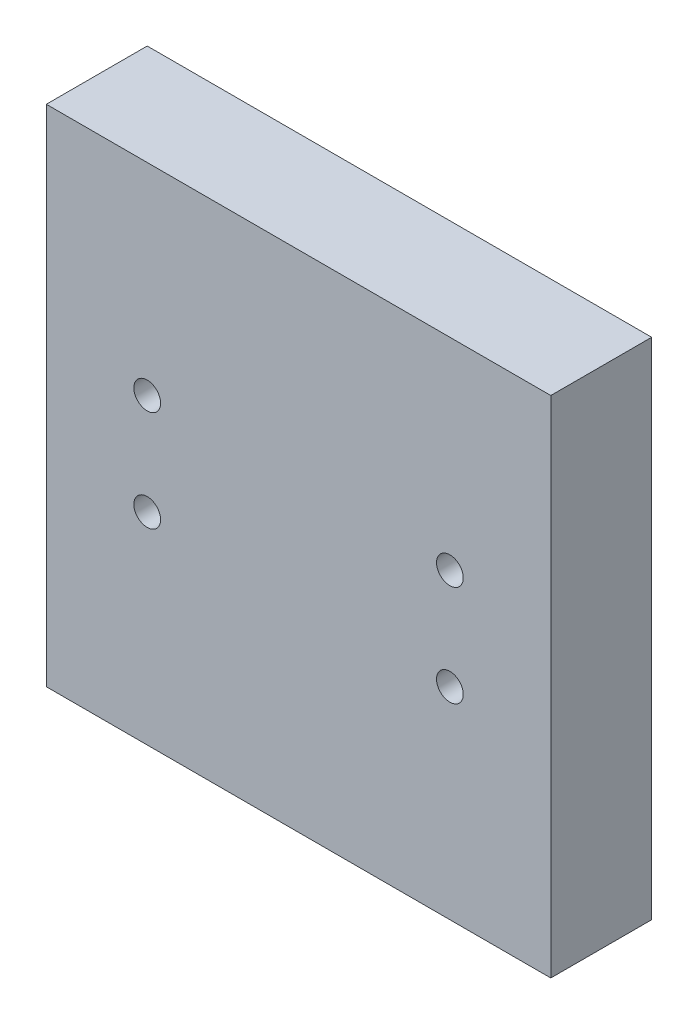
ISO-10303-21;
HEADER;
FILE_DESCRIPTION(('STEP AP214'),'2;1');
FILE_NAME('part.step','',(''),(''),'','','');
FILE_SCHEMA(('AUTOMOTIVE_DESIGN { 1 0 10303 214 1 1 1 1 }'));
ENDSEC;
DATA;
#1=APPLICATION_CONTEXT('core data for automotive mechanical design processes');
#2=APPLICATION_PROTOCOL_DEFINITION('international standard','automotive_design',2000,#1);
#3=PRODUCT_CONTEXT('',#1,'mechanical');
#4=PRODUCT('Part','Part','',(#3));
#5=PRODUCT_RELATED_PRODUCT_CATEGORY('part','',(#4));
#6=PRODUCT_DEFINITION_FORMATION('','',#4);
#7=PRODUCT_DEFINITION_CONTEXT('part definition',#1,'design');
#8=PRODUCT_DEFINITION('design','',#6,#7);
#9=PRODUCT_DEFINITION_SHAPE('','',#8);
#10=(LENGTH_UNIT() NAMED_UNIT(*) SI_UNIT(.MILLI.,.METRE.));
#11=(NAMED_UNIT(*) PLANE_ANGLE_UNIT() SI_UNIT($,.RADIAN.));
#12=(NAMED_UNIT(*) SI_UNIT($,.STERADIAN.) SOLID_ANGLE_UNIT());
#13=UNCERTAINTY_MEASURE_WITH_UNIT(LENGTH_MEASURE(1.E-05),#10,'distance_accuracy_value','');
#14=(GEOMETRIC_REPRESENTATION_CONTEXT(3) GLOBAL_UNCERTAINTY_ASSIGNED_CONTEXT((#13)) GLOBAL_UNIT_ASSIGNED_CONTEXT((#10,
#11,#12)) REPRESENTATION_CONTEXT('',''));
#15=CARTESIAN_POINT('',(0.,0.,0.));
#16=DIRECTION('',(0.,0.,1.));
#17=DIRECTION('',(1.,0.,0.));
#18=AXIS2_PLACEMENT_3D('',#15,#16,#17);
#19=CARTESIAN_POINT('',(50.,-50.,20.));
#20=DIRECTION('',(-1.,0.,0.));
#21=DIRECTION('',(0.,0.,1.));
#22=AXIS2_PLACEMENT_3D('',#19,#20,#21);
#23=PLANE('',#22);
#24=DIRECTION('',(0.,1.,0.));
#25=VECTOR('',#24,1.);
#26=CARTESIAN_POINT('',(50.,-50.,0.));
#27=LINE('',#26,#25);
#28=CARTESIAN_POINT('',(50.,-50.,0.));
#29=VERTEX_POINT('',#28);
#30=CARTESIAN_POINT('',(50.,50.,0.));
#31=VERTEX_POINT('',#30);
#32=EDGE_CURVE('E95',#29,#31,#27,.T.);
#33=ORIENTED_EDGE('',*,*,#32,.T.);
#34=DIRECTION('',(0.,0.,-1.));
#35=VECTOR('',#34,1.);
#36=CARTESIAN_POINT('',(50.,50.,20.));
#37=LINE('',#36,#35);
#38=CARTESIAN_POINT('',(50.,50.,20.));
#39=VERTEX_POINT('',#38);
#40=EDGE_CURVE('E11',#39,#31,#37,.T.);
#41=ORIENTED_EDGE('',*,*,#40,.F.);
#42=DIRECTION('',(0.,1.,0.));
#43=VECTOR('',#42,1.);
#44=CARTESIAN_POINT('',(50.,-50.,20.));
#45=LINE('',#44,#43);
#46=CARTESIAN_POINT('',(50.,-50.,20.));
#47=VERTEX_POINT('',#46);
#48=EDGE_CURVE('E83',#47,#39,#45,.T.);
#49=ORIENTED_EDGE('',*,*,#48,.F.);
#50=DIRECTION('',(0.,0.,-1.));
#51=VECTOR('',#50,1.);
#52=CARTESIAN_POINT('',(50.,-50.,20.));
#53=LINE('',#52,#51);
#54=EDGE_CURVE('E91',#47,#29,#53,.T.);
#55=ORIENTED_EDGE('',*,*,#54,.T.);
#56=EDGE_LOOP('',(#33,#41,#49,#55));
#57=FACE_BOUND('',#56,.T.);
#58=ADVANCED_FACE('F32',(#57),#23,.F.);
#59=CARTESIAN_POINT('',(-50.,50.,20.));
#60=DIRECTION('',(0.,-1.,0.));
#61=DIRECTION('',(0.,0.,-1.));
#62=AXIS2_PLACEMENT_3D('',#59,#60,#61);
#63=PLANE('',#62);
#64=DIRECTION('',(-1.,0.,0.));
#65=VECTOR('',#64,1.);
#66=CARTESIAN_POINT('',(-50.,50.,0.));
#67=LINE('',#66,#65);
#68=CARTESIAN_POINT('',(-50.,50.,0.));
#69=VERTEX_POINT('',#68);
#70=EDGE_CURVE('E87',#31,#69,#67,.T.);
#71=ORIENTED_EDGE('',*,*,#70,.T.);
#72=DIRECTION('',(0.,0.,-1.));
#73=VECTOR('',#72,1.);
#74=CARTESIAN_POINT('',(-50.,50.,20.));
#75=LINE('',#74,#73);
#76=CARTESIAN_POINT('',(-50.,50.,20.));
#77=VERTEX_POINT('',#76);
#78=EDGE_CURVE('E40',#77,#69,#75,.T.);
#79=ORIENTED_EDGE('',*,*,#78,.F.);
#80=DIRECTION('',(-1.,0.,0.));
#81=VECTOR('',#80,1.);
#82=CARTESIAN_POINT('',(-50.,50.,20.));
#83=LINE('',#82,#81);
#84=EDGE_CURVE('E78',#39,#77,#83,.T.);
#85=ORIENTED_EDGE('',*,*,#84,.F.);
#86=ORIENTED_EDGE('',*,*,#40,.T.);
#87=EDGE_LOOP('',(#71,#79,#85,#86));
#88=FACE_BOUND('',#87,.T.);
#89=ADVANCED_FACE('F86',(#88),#63,.F.);
#90=CARTESIAN_POINT('',(-50.,-50.,20.));
#91=DIRECTION('',(1.,0.,0.));
#92=DIRECTION('',(0.,0.,-1.));
#93=AXIS2_PLACEMENT_3D('',#90,#91,#92);
#94=PLANE('',#93);
#95=DIRECTION('',(0.,-1.,0.));
#96=VECTOR('',#95,1.);
#97=CARTESIAN_POINT('',(-50.,-50.,0.));
#98=LINE('',#97,#96);
#99=CARTESIAN_POINT('',(-50.,-50.,0.));
#100=VERTEX_POINT('',#99);
#101=EDGE_CURVE('E65',#69,#100,#98,.T.);
#102=ORIENTED_EDGE('',*,*,#101,.T.);
#103=DIRECTION('',(0.,0.,-1.));
#104=VECTOR('',#103,1.);
#105=CARTESIAN_POINT('',(-50.,-50.,20.));
#106=LINE('',#105,#104);
#107=CARTESIAN_POINT('',(-50.,-50.,20.));
#108=VERTEX_POINT('',#107);
#109=EDGE_CURVE('E88',#108,#100,#106,.T.);
#110=ORIENTED_EDGE('',*,*,#109,.F.);
#111=DIRECTION('',(0.,-1.,0.));
#112=VECTOR('',#111,1.);
#113=CARTESIAN_POINT('',(-50.,-50.,20.));
#114=LINE('',#113,#112);
#115=EDGE_CURVE('E81',#77,#108,#114,.T.);
#116=ORIENTED_EDGE('',*,*,#115,.F.);
#117=ORIENTED_EDGE('',*,*,#78,.T.);
#118=EDGE_LOOP('',(#102,#110,#116,#117));
#119=FACE_BOUND('',#118,.T.);
#120=ADVANCED_FACE('F89',(#119),#94,.F.);
#121=CARTESIAN_POINT('',(-50.,-50.,20.));
#122=DIRECTION('',(0.,1.,0.));
#123=DIRECTION('',(0.,0.,1.));
#124=AXIS2_PLACEMENT_3D('',#121,#122,#123);
#125=PLANE('',#124);
#126=DIRECTION('',(1.,0.,0.));
#127=VECTOR('',#126,1.);
#128=CARTESIAN_POINT('',(-50.,-50.,0.));
#129=LINE('',#128,#127);
#130=EDGE_CURVE('E71',#100,#29,#129,.T.);
#131=ORIENTED_EDGE('',*,*,#130,.T.);
#132=ORIENTED_EDGE('',*,*,#54,.F.);
#133=DIRECTION('',(1.,0.,0.));
#134=VECTOR('',#133,1.);
#135=CARTESIAN_POINT('',(-50.,-50.,20.));
#136=LINE('',#135,#134);
#137=EDGE_CURVE('E48',#108,#47,#136,.T.);
#138=ORIENTED_EDGE('',*,*,#137,.F.);
#139=ORIENTED_EDGE('',*,*,#109,.T.);
#140=EDGE_LOOP('',(#131,#132,#138,#139));
#141=FACE_BOUND('',#140,.T.);
#142=ADVANCED_FACE('F103',(#141),#125,.F.);
#143=CARTESIAN_POINT('',(50.,50.,20.));
#144=DIRECTION('',(0.,0.,-1.));
#145=DIRECTION('',(-1.,0.,0.));
#146=AXIS2_PLACEMENT_3D('',#143,#144,#145);
#147=PLANE('',#146);
#148=CARTESIAN_POINT('',(30.,10.,20.));
#149=DIRECTION('',(0.,0.,-1.));
#150=DIRECTION('',(-1.,0.,0.));
#151=AXIS2_PLACEMENT_3D('',#148,#149,#150);
#152=CIRCLE('',#151,2.65);
#153=CARTESIAN_POINT('',(27.35,10.,20.));
#154=VERTEX_POINT('',#153);
#155=EDGE_CURVE('E135',#154,#154,#152,.T.);
#156=ORIENTED_EDGE('',*,*,#155,.T.);
#157=EDGE_LOOP('',(#156));
#158=FACE_BOUND('',#157,.T.);
#159=CARTESIAN_POINT('',(-30.,10.,20.));
#160=DIRECTION('',(0.,0.,-1.));
#161=DIRECTION('',(-1.,0.,0.));
#162=AXIS2_PLACEMENT_3D('',#159,#160,#161);
#163=CIRCLE('',#162,2.65);
#164=CARTESIAN_POINT('',(-32.65,10.,20.));
#165=VERTEX_POINT('',#164);
#166=EDGE_CURVE('E126',#165,#165,#163,.T.);
#167=ORIENTED_EDGE('',*,*,#166,.T.);
#168=EDGE_LOOP('',(#167));
#169=FACE_BOUND('',#168,.T.);
#170=CARTESIAN_POINT('',(-30.,-10.,20.));
#171=DIRECTION('',(0.,0.,-1.));
#172=DIRECTION('',(-1.,0.,0.));
#173=AXIS2_PLACEMENT_3D('',#170,#171,#172);
#174=CIRCLE('',#173,2.65);
#175=CARTESIAN_POINT('',(-32.65,-10.,20.));
#176=VERTEX_POINT('',#175);
#177=EDGE_CURVE('E117',#176,#176,#174,.T.);
#178=ORIENTED_EDGE('',*,*,#177,.T.);
#179=EDGE_LOOP('',(#178));
#180=FACE_BOUND('',#179,.T.);
#181=CARTESIAN_POINT('',(30.,-10.,20.));
#182=DIRECTION('',(0.,0.,-1.));
#183=DIRECTION('',(-1.,0.,0.));
#184=AXIS2_PLACEMENT_3D('',#181,#182,#183);
#185=CIRCLE('',#184,2.65);
#186=CARTESIAN_POINT('',(27.35,-10.,20.));
#187=VERTEX_POINT('',#186);
#188=EDGE_CURVE('E98',#187,#187,#185,.T.);
#189=ORIENTED_EDGE('',*,*,#188,.T.);
#190=EDGE_LOOP('',(#189));
#191=FACE_BOUND('',#190,.T.);
#192=ORIENTED_EDGE('',*,*,#48,.T.);
#193=ORIENTED_EDGE('',*,*,#84,.T.);
#194=ORIENTED_EDGE('',*,*,#115,.T.);
#195=ORIENTED_EDGE('',*,*,#137,.T.);
#196=EDGE_LOOP('',(#192,#193,#194,#195));
#197=FACE_BOUND('',#196,.T.);
#198=ADVANCED_FACE('F79',(#158,#169,#180,#191,#197),#147,.F.);
#199=CARTESIAN_POINT('',(50.,50.,0.));
#200=DIRECTION('',(0.,0.,-1.));
#201=DIRECTION('',(-1.,0.,0.));
#202=AXIS2_PLACEMENT_3D('',#199,#200,#201);
#203=PLANE('',#202);
#204=CARTESIAN_POINT('',(30.,10.,0.));
#205=DIRECTION('',(0.,0.,-1.));
#206=DIRECTION('',(-1.,0.,0.));
#207=AXIS2_PLACEMENT_3D('',#204,#205,#206);
#208=CIRCLE('',#207,5.2);
#209=CARTESIAN_POINT('',(24.8,10.,0.));
#210=VERTEX_POINT('',#209);
#211=EDGE_CURVE('E141',#210,#210,#208,.T.);
#212=ORIENTED_EDGE('',*,*,#211,.F.);
#213=EDGE_LOOP('',(#212));
#214=FACE_BOUND('',#213,.T.);
#215=CARTESIAN_POINT('',(-30.,10.,0.));
#216=DIRECTION('',(0.,0.,-1.));
#217=DIRECTION('',(-1.,0.,0.));
#218=AXIS2_PLACEMENT_3D('',#215,#216,#217);
#219=CIRCLE('',#218,5.2);
#220=CARTESIAN_POINT('',(-35.2,10.,0.));
#221=VERTEX_POINT('',#220);
#222=EDGE_CURVE('E132',#221,#221,#219,.T.);
#223=ORIENTED_EDGE('',*,*,#222,.F.);
#224=EDGE_LOOP('',(#223));
#225=FACE_BOUND('',#224,.T.);
#226=CARTESIAN_POINT('',(-30.,-10.,0.));
#227=DIRECTION('',(0.,0.,-1.));
#228=DIRECTION('',(-1.,0.,0.));
#229=AXIS2_PLACEMENT_3D('',#226,#227,#228);
#230=CIRCLE('',#229,5.2);
#231=CARTESIAN_POINT('',(-35.2,-10.,0.));
#232=VERTEX_POINT('',#231);
#233=EDGE_CURVE('E123',#232,#232,#230,.T.);
#234=ORIENTED_EDGE('',*,*,#233,.F.);
#235=EDGE_LOOP('',(#234));
#236=FACE_BOUND('',#235,.T.);
#237=CARTESIAN_POINT('',(30.,-10.,0.));
#238=DIRECTION('',(0.,0.,-1.));
#239=DIRECTION('',(-1.,0.,0.));
#240=AXIS2_PLACEMENT_3D('',#237,#238,#239);
#241=CIRCLE('',#240,5.2);
#242=CARTESIAN_POINT('',(24.8,-10.,0.));
#243=VERTEX_POINT('',#242);
#244=EDGE_CURVE('E114',#243,#243,#241,.T.);
#245=ORIENTED_EDGE('',*,*,#244,.F.);
#246=EDGE_LOOP('',(#245));
#247=FACE_BOUND('',#246,.T.);
#248=ORIENTED_EDGE('',*,*,#32,.F.);
#249=ORIENTED_EDGE('',*,*,#130,.F.);
#250=ORIENTED_EDGE('',*,*,#101,.F.);
#251=ORIENTED_EDGE('',*,*,#70,.F.);
#252=EDGE_LOOP('',(#248,#249,#250,#251));
#253=FACE_BOUND('',#252,.T.);
#254=ADVANCED_FACE('F106',(#214,#225,#236,#247,#253),#203,.T.);
#255=CARTESIAN_POINT('',(30.,-10.,0.));
#256=DIRECTION('',(0.,0.,-1.));
#257=DIRECTION('',(-1.,0.,0.));
#258=AXIS2_PLACEMENT_3D('',#255,#256,#257);
#259=CYLINDRICAL_SURFACE('',#258,2.65);
#260=ORIENTED_EDGE('',*,*,#188,.F.);
#261=EDGE_LOOP('',(#260));
#262=FACE_BOUND('',#261,.T.);
#263=CARTESIAN_POINT('',(30.,-10.,2.55));
#264=DIRECTION('',(0.,0.,-1.));
#265=DIRECTION('',(-1.,0.,0.));
#266=AXIS2_PLACEMENT_3D('',#263,#264,#265);
#267=CIRCLE('',#266,2.65);
#268=CARTESIAN_POINT('',(27.35,-10.,2.55));
#269=VERTEX_POINT('',#268);
#270=EDGE_CURVE('E111',#269,#269,#267,.T.);
#271=ORIENTED_EDGE('',*,*,#270,.T.);
#272=EDGE_LOOP('',(#271));
#273=FACE_BOUND('',#272,.T.);
#274=ADVANCED_FACE('F149',(#262,#273),#259,.F.);
#275=CARTESIAN_POINT('',(30.,-10.,0.));
#276=DIRECTION('',(0.,0.,-1.));
#277=DIRECTION('',(-1.,0.,0.));
#278=AXIS2_PLACEMENT_3D('',#275,#276,#277);
#279=CONICAL_SURFACE('',#278,5.2,0.785398163397448);
#280=ORIENTED_EDGE('',*,*,#270,.F.);
#281=EDGE_LOOP('',(#280));
#282=FACE_BOUND('',#281,.T.);
#283=ORIENTED_EDGE('',*,*,#244,.T.);
#284=EDGE_LOOP('',(#283));
#285=FACE_BOUND('',#284,.T.);
#286=ADVANCED_FACE('F157',(#282,#285),#279,.F.);
#287=CARTESIAN_POINT('',(-30.,-10.,0.));
#288=DIRECTION('',(0.,0.,-1.));
#289=DIRECTION('',(-1.,0.,0.));
#290=AXIS2_PLACEMENT_3D('',#287,#288,#289);
#291=CYLINDRICAL_SURFACE('',#290,2.65);
#292=ORIENTED_EDGE('',*,*,#177,.F.);
#293=EDGE_LOOP('',(#292));
#294=FACE_BOUND('',#293,.T.);
#295=CARTESIAN_POINT('',(-30.,-10.,2.55));
#296=DIRECTION('',(0.,0.,-1.));
#297=DIRECTION('',(-1.,0.,0.));
#298=AXIS2_PLACEMENT_3D('',#295,#296,#297);
#299=CIRCLE('',#298,2.65);
#300=CARTESIAN_POINT('',(-32.65,-10.,2.55));
#301=VERTEX_POINT('',#300);
#302=EDGE_CURVE('E120',#301,#301,#299,.T.);
#303=ORIENTED_EDGE('',*,*,#302,.T.);
#304=EDGE_LOOP('',(#303));
#305=FACE_BOUND('',#304,.T.);
#306=ADVANCED_FACE('F159',(#294,#305),#291,.F.);
#307=CARTESIAN_POINT('',(-30.,-10.,0.));
#308=DIRECTION('',(0.,0.,-1.));
#309=DIRECTION('',(-1.,0.,0.));
#310=AXIS2_PLACEMENT_3D('',#307,#308,#309);
#311=CONICAL_SURFACE('',#310,5.2,0.785398163397448);
#312=ORIENTED_EDGE('',*,*,#302,.F.);
#313=EDGE_LOOP('',(#312));
#314=FACE_BOUND('',#313,.T.);
#315=ORIENTED_EDGE('',*,*,#233,.T.);
#316=EDGE_LOOP('',(#315));
#317=FACE_BOUND('',#316,.T.);
#318=ADVANCED_FACE('F166',(#314,#317),#311,.F.);
#319=CARTESIAN_POINT('',(-30.,10.,0.));
#320=DIRECTION('',(0.,0.,-1.));
#321=DIRECTION('',(-1.,0.,0.));
#322=AXIS2_PLACEMENT_3D('',#319,#320,#321);
#323=CYLINDRICAL_SURFACE('',#322,2.65);
#324=ORIENTED_EDGE('',*,*,#166,.F.);
#325=EDGE_LOOP('',(#324));
#326=FACE_BOUND('',#325,.T.);
#327=CARTESIAN_POINT('',(-30.,10.,2.55));
#328=DIRECTION('',(0.,0.,-1.));
#329=DIRECTION('',(-1.,0.,0.));
#330=AXIS2_PLACEMENT_3D('',#327,#328,#329);
#331=CIRCLE('',#330,2.65);
#332=CARTESIAN_POINT('',(-32.65,10.,2.55));
#333=VERTEX_POINT('',#332);
#334=EDGE_CURVE('E129',#333,#333,#331,.T.);
#335=ORIENTED_EDGE('',*,*,#334,.T.);
#336=EDGE_LOOP('',(#335));
#337=FACE_BOUND('',#336,.T.);
#338=ADVANCED_FACE('F200',(#326,#337),#323,.F.);
#339=CARTESIAN_POINT('',(-30.,10.,0.));
#340=DIRECTION('',(0.,0.,-1.));
#341=DIRECTION('',(-1.,0.,0.));
#342=AXIS2_PLACEMENT_3D('',#339,#340,#341);
#343=CONICAL_SURFACE('',#342,5.2,0.785398163397448);
#344=ORIENTED_EDGE('',*,*,#334,.F.);
#345=EDGE_LOOP('',(#344));
#346=FACE_BOUND('',#345,.T.);
#347=ORIENTED_EDGE('',*,*,#222,.T.);
#348=EDGE_LOOP('',(#347));
#349=FACE_BOUND('',#348,.T.);
#350=ADVANCED_FACE('F205',(#346,#349),#343,.F.);
#351=CARTESIAN_POINT('',(30.,10.,0.));
#352=DIRECTION('',(0.,0.,-1.));
#353=DIRECTION('',(-1.,0.,0.));
#354=AXIS2_PLACEMENT_3D('',#351,#352,#353);
#355=CYLINDRICAL_SURFACE('',#354,2.65);
#356=ORIENTED_EDGE('',*,*,#155,.F.);
#357=EDGE_LOOP('',(#356));
#358=FACE_BOUND('',#357,.T.);
#359=CARTESIAN_POINT('',(30.,10.,2.55));
#360=DIRECTION('',(0.,0.,-1.));
#361=DIRECTION('',(-1.,0.,0.));
#362=AXIS2_PLACEMENT_3D('',#359,#360,#361);
#363=CIRCLE('',#362,2.65);
#364=CARTESIAN_POINT('',(27.35,10.,2.55));
#365=VERTEX_POINT('',#364);
#366=EDGE_CURVE('E138',#365,#365,#363,.T.);
#367=ORIENTED_EDGE('',*,*,#366,.T.);
#368=EDGE_LOOP('',(#367));
#369=FACE_BOUND('',#368,.T.);
#370=ADVANCED_FACE('F211',(#358,#369),#355,.F.);
#371=CARTESIAN_POINT('',(30.,10.,0.));
#372=DIRECTION('',(0.,0.,-1.));
#373=DIRECTION('',(-1.,0.,0.));
#374=AXIS2_PLACEMENT_3D('',#371,#372,#373);
#375=CONICAL_SURFACE('',#374,5.2,0.785398163397448);
#376=ORIENTED_EDGE('',*,*,#366,.F.);
#377=EDGE_LOOP('',(#376));
#378=FACE_BOUND('',#377,.T.);
#379=ORIENTED_EDGE('',*,*,#211,.T.);
#380=EDGE_LOOP('',(#379));
#381=FACE_BOUND('',#380,.T.);
#382=ADVANCED_FACE('F145',(#378,#381),#375,.F.);
#383=CLOSED_SHELL('',(#58,#89,#120,#142,#198,#254,#274,#286,#306,#318,#338,#350,#370,#382));
#384=MANIFOLD_SOLID_BREP('B2',#383);
#385=ADVANCED_BREP_SHAPE_REPRESENTATION('',(#18,#384),#14);
#386=SHAPE_DEFINITION_REPRESENTATION(#9,#385);
ENDSEC;
END-ISO-10303-21;
